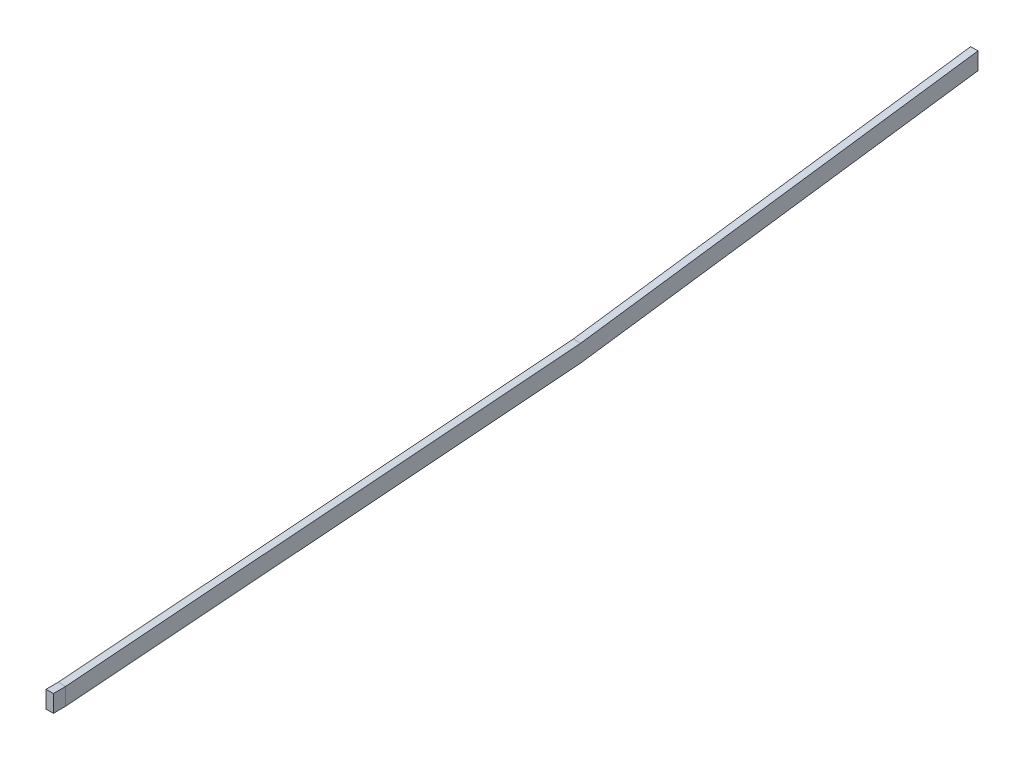
ISO-10303-21;
HEADER;
FILE_DESCRIPTION(('STEP AP214'),'2;1');
FILE_NAME('part.step','',(''),(''),'','','');
FILE_SCHEMA(('AUTOMOTIVE_DESIGN { 1 0 10303 214 1 1 1 1 }'));
ENDSEC;
DATA;
#1=APPLICATION_CONTEXT('core data for automotive mechanical design processes');
#2=APPLICATION_PROTOCOL_DEFINITION('international standard','automotive_design',2000,#1);
#3=PRODUCT_CONTEXT('',#1,'mechanical');
#4=PRODUCT('Part','Part','',(#3));
#5=PRODUCT_RELATED_PRODUCT_CATEGORY('part','',(#4));
#6=PRODUCT_DEFINITION_FORMATION('','',#4);
#7=PRODUCT_DEFINITION_CONTEXT('part definition',#1,'design');
#8=PRODUCT_DEFINITION('design','',#6,#7);
#9=PRODUCT_DEFINITION_SHAPE('','',#8);
#10=(LENGTH_UNIT() NAMED_UNIT(*) SI_UNIT(.MILLI.,.METRE.));
#11=(NAMED_UNIT(*) PLANE_ANGLE_UNIT() SI_UNIT($,.RADIAN.));
#12=(NAMED_UNIT(*) SI_UNIT($,.STERADIAN.) SOLID_ANGLE_UNIT());
#13=UNCERTAINTY_MEASURE_WITH_UNIT(LENGTH_MEASURE(1.E-05),#10,'distance_accuracy_value','');
#14=(GEOMETRIC_REPRESENTATION_CONTEXT(3) GLOBAL_UNCERTAINTY_ASSIGNED_CONTEXT((#13)) GLOBAL_UNIT_ASSIGNED_CONTEXT((#10,
#11,#12)) REPRESENTATION_CONTEXT('',''));
#15=CARTESIAN_POINT('',(0.,0.,0.));
#16=DIRECTION('',(0.,0.,1.));
#17=DIRECTION('',(1.,0.,0.));
#18=AXIS2_PLACEMENT_3D('',#15,#16,#17);
#19=CARTESIAN_POINT('',(0.,0.,0.));
#20=DIRECTION('',(0.,0.,-1.));
#21=DIRECTION('',(-1.,0.,0.));
#22=AXIS2_PLACEMENT_3D('',#19,#20,#21);
#23=PLANE('',#22);
#24=DIRECTION('',(0.,1.,0.));
#25=VECTOR('',#24,1.);
#26=CARTESIAN_POINT('',(3.,0.,0.));
#27=LINE('',#26,#25);
#28=CARTESIAN_POINT('',(3.,0.,0.));
#29=VERTEX_POINT('',#28);
#30=CARTESIAN_POINT('',(3.,7.,0.));
#31=VERTEX_POINT('',#30);
#32=EDGE_CURVE('E111',#29,#31,#27,.T.);
#33=ORIENTED_EDGE('',*,*,#32,.F.);
#34=DIRECTION('',(1.,0.,0.));
#35=VECTOR('',#34,1.);
#36=CARTESIAN_POINT('',(0.,0.,0.));
#37=LINE('',#36,#35);
#38=CARTESIAN_POINT('',(0.,0.,0.));
#39=VERTEX_POINT('',#38);
#40=EDGE_CURVE('E12',#39,#29,#37,.T.);
#41=ORIENTED_EDGE('',*,*,#40,.F.);
#42=DIRECTION('',(0.,1.,0.));
#43=VECTOR('',#42,1.);
#44=CARTESIAN_POINT('',(0.,0.,0.));
#45=LINE('',#44,#43);
#46=CARTESIAN_POINT('',(0.,7.,0.));
#47=VERTEX_POINT('',#46);
#48=EDGE_CURVE('E105',#39,#47,#45,.T.);
#49=ORIENTED_EDGE('',*,*,#48,.T.);
#50=DIRECTION('',(1.,0.,0.));
#51=VECTOR('',#50,1.);
#52=CARTESIAN_POINT('',(0.,7.,0.));
#53=LINE('',#52,#51);
#54=EDGE_CURVE('E50',#47,#31,#53,.T.);
#55=ORIENTED_EDGE('',*,*,#54,.T.);
#56=EDGE_LOOP('',(#33,#41,#49,#55));
#57=FACE_BOUND('',#56,.T.);
#58=ADVANCED_FACE('F47',(#57),#23,.T.);
#59=CARTESIAN_POINT('',(0.,0.,0.));
#60=DIRECTION('',(0.,-1.,0.));
#61=DIRECTION('',(0.,0.,-1.));
#62=AXIS2_PLACEMENT_3D('',#59,#60,#61);
#63=PLANE('',#62);
#64=DIRECTION('',(0.,0.,-1.));
#65=VECTOR('',#64,1.);
#66=CARTESIAN_POINT('',(3.,0.,0.));
#67=LINE('',#66,#65);
#68=CARTESIAN_POINT('',(3.,0.,5.));
#69=VERTEX_POINT('',#68);
#70=EDGE_CURVE('E107',#69,#29,#67,.T.);
#71=ORIENTED_EDGE('',*,*,#70,.F.);
#72=DIRECTION('',(1.,0.,0.));
#73=VECTOR('',#72,1.);
#74=CARTESIAN_POINT('',(0.,0.,5.));
#75=LINE('',#74,#73);
#76=CARTESIAN_POINT('',(0.,0.,5.));
#77=VERTEX_POINT('',#76);
#78=EDGE_CURVE('E56',#77,#69,#75,.T.);
#79=ORIENTED_EDGE('',*,*,#78,.F.);
#80=DIRECTION('',(0.,0.,-1.));
#81=VECTOR('',#80,1.);
#82=CARTESIAN_POINT('',(0.,0.,0.));
#83=LINE('',#82,#81);
#84=EDGE_CURVE('E102',#77,#39,#83,.T.);
#85=ORIENTED_EDGE('',*,*,#84,.T.);
#86=ORIENTED_EDGE('',*,*,#40,.T.);
#87=EDGE_LOOP('',(#71,#79,#85,#86));
#88=FACE_BOUND('',#87,.T.);
#89=ADVANCED_FACE('F121',(#88),#63,.T.);
#90=CARTESIAN_POINT('',(0.,0.,5.));
#91=DIRECTION('',(0.,0.,1.));
#92=DIRECTION('',(1.,0.,0.));
#93=AXIS2_PLACEMENT_3D('',#90,#91,#92);
#94=PLANE('',#93);
#95=DIRECTION('',(0.,-1.,0.));
#96=VECTOR('',#95,1.);
#97=CARTESIAN_POINT('',(3.,0.,5.));
#98=LINE('',#97,#96);
#99=CARTESIAN_POINT('',(3.,7.,5.));
#100=VERTEX_POINT('',#99);
#101=EDGE_CURVE('E97',#100,#69,#98,.T.);
#102=ORIENTED_EDGE('',*,*,#101,.F.);
#103=DIRECTION('',(1.,0.,0.));
#104=VECTOR('',#103,1.);
#105=CARTESIAN_POINT('',(0.,7.,5.));
#106=LINE('',#105,#104);
#107=CARTESIAN_POINT('',(0.,7.,5.));
#108=VERTEX_POINT('',#107);
#109=EDGE_CURVE('E92',#108,#100,#106,.T.);
#110=ORIENTED_EDGE('',*,*,#109,.F.);
#111=DIRECTION('',(0.,-1.,0.));
#112=VECTOR('',#111,1.);
#113=CARTESIAN_POINT('',(0.,0.,5.));
#114=LINE('',#113,#112);
#115=EDGE_CURVE('E95',#108,#77,#114,.T.);
#116=ORIENTED_EDGE('',*,*,#115,.T.);
#117=ORIENTED_EDGE('',*,*,#78,.T.);
#118=EDGE_LOOP('',(#102,#110,#116,#117));
#119=FACE_BOUND('',#118,.T.);
#120=ADVANCED_FACE('F94',(#119),#94,.T.);
#121=CARTESIAN_POINT('',(0.,7.,0.));
#122=DIRECTION('',(0.,1.,0.));
#123=DIRECTION('',(0.,0.,1.));
#124=AXIS2_PLACEMENT_3D('',#121,#122,#123);
#125=PLANE('',#124);
#126=DIRECTION('',(0.,0.,1.));
#127=VECTOR('',#126,1.);
#128=CARTESIAN_POINT('',(3.,7.,0.));
#129=LINE('',#128,#127);
#130=EDGE_CURVE('E114',#31,#100,#129,.T.);
#131=ORIENTED_EDGE('',*,*,#130,.F.);
#132=ORIENTED_EDGE('',*,*,#54,.F.);
#133=DIRECTION('',(0.,0.,1.));
#134=VECTOR('',#133,1.);
#135=CARTESIAN_POINT('',(0.,7.,0.));
#136=LINE('',#135,#134);
#137=EDGE_CURVE('E101',#47,#108,#136,.T.);
#138=ORIENTED_EDGE('',*,*,#137,.T.);
#139=ORIENTED_EDGE('',*,*,#109,.T.);
#140=EDGE_LOOP('',(#131,#132,#138,#139));
#141=FACE_BOUND('',#140,.T.);
#142=ADVANCED_FACE('F104',(#141),#125,.T.);
#143=CARTESIAN_POINT('',(0.,0.,0.));
#144=DIRECTION('',(1.,0.,0.));
#145=DIRECTION('',(0.,0.,-1.));
#146=AXIS2_PLACEMENT_3D('',#143,#144,#145);
#147=PLANE('',#146);
#148=ORIENTED_EDGE('',*,*,#48,.F.);
#149=ORIENTED_EDGE('',*,*,#84,.F.);
#150=ORIENTED_EDGE('',*,*,#115,.F.);
#151=ORIENTED_EDGE('',*,*,#137,.F.);
#152=EDGE_LOOP('',(#148,#149,#150,#151));
#153=FACE_BOUND('',#152,.T.);
#154=ADVANCED_FACE('F100',(#153),#147,.F.);
#155=CARTESIAN_POINT('',(3.,0.,0.));
#156=DIRECTION('',(1.,0.,0.));
#157=DIRECTION('',(0.,0.,-1.));
#158=AXIS2_PLACEMENT_3D('',#155,#156,#157);
#159=PLANE('',#158);
#160=ORIENTED_EDGE('',*,*,#32,.T.);
#161=ORIENTED_EDGE('',*,*,#130,.T.);
#162=ORIENTED_EDGE('',*,*,#101,.T.);
#163=ORIENTED_EDGE('',*,*,#70,.T.);
#164=EDGE_LOOP('',(#160,#161,#162,#163));
#165=FACE_BOUND('',#164,.T.);
#166=ADVANCED_FACE('F120',(#165),#159,.T.);
#167=CLOSED_SHELL('',(#58,#89,#120,#142,#154,#166));
#168=MANIFOLD_SOLID_BREP('B2',#167);
#169=CARTESIAN_POINT('',(3.,0.,0.));
#170=DIRECTION('',(0.,0.997039347044609,0.0768930454908585));
#171=DIRECTION('',(0.,-0.0768930454908585,0.997039347044609));
#172=AXIS2_PLACEMENT_3D('',#169,#170,#171);
#173=PLANE('',#172);
#174=DIRECTION('',(0.,0.0768930454908585,-0.997039347044609));
#175=VECTOR('',#174,1.);
#176=CARTESIAN_POINT('',(0.,0.,0.));
#177=LINE('',#176,#175);
#178=CARTESIAN_POINT('',(0.,0.,0.));
#179=VERTEX_POINT('',#178);
#180=CARTESIAN_POINT('',(0.,16.1954887747853,-210.));
#181=VERTEX_POINT('',#180);
#182=EDGE_CURVE('E267',#179,#181,#177,.T.);
#183=ORIENTED_EDGE('',*,*,#182,.T.);
#184=DIRECTION('',(-1.,0.,0.));
#185=VECTOR('',#184,1.);
#186=CARTESIAN_POINT('',(3.,16.1954887747853,-210.));
#187=LINE('',#186,#185);
#188=CARTESIAN_POINT('',(3.,16.1954887747853,-210.));
#189=VERTEX_POINT('',#188);
#190=EDGE_CURVE('E45',#189,#181,#187,.T.);
#191=ORIENTED_EDGE('',*,*,#190,.F.);
#192=DIRECTION('',(0.,0.0768930454908585,-0.997039347044609));
#193=VECTOR('',#192,1.);
#194=CARTESIAN_POINT('',(3.,0.,0.));
#195=LINE('',#194,#193);
#196=CARTESIAN_POINT('',(3.,0.,0.));
#197=VERTEX_POINT('',#196);
#198=EDGE_CURVE('E277',#197,#189,#195,.T.);
#199=ORIENTED_EDGE('',*,*,#198,.F.);
#200=DIRECTION('',(-1.,0.,0.));
#201=VECTOR('',#200,1.);
#202=CARTESIAN_POINT('',(3.,0.,0.));
#203=LINE('',#202,#201);
#204=EDGE_CURVE('E263',#197,#179,#203,.T.);
#205=ORIENTED_EDGE('',*,*,#204,.T.);
#206=EDGE_LOOP('',(#183,#191,#199,#205));
#207=FACE_BOUND('',#206,.T.);
#208=ADVANCED_FACE('F183',(#207),#173,.F.);
#209=CARTESIAN_POINT('',(3.,16.1954887747853,-210.));
#210=DIRECTION('',(0.,0.99072413854576,0.135888488485089));
#211=DIRECTION('',(0.,-0.135888488485089,0.99072413854576));
#212=AXIS2_PLACEMENT_3D('',#209,#210,#211);
#213=PLANE('',#212);
#214=DIRECTION('',(0.,0.135888488485089,-0.99072413854576));
#215=VECTOR('',#214,1.);
#216=CARTESIAN_POINT('',(0.,16.1954887747853,-210.));
#217=LINE('',#216,#215);
#218=CARTESIAN_POINT('',(0.,38.4155339701086,-372.));
#219=VERTEX_POINT('',#218);
#220=EDGE_CURVE('E270',#181,#219,#217,.T.);
#221=ORIENTED_EDGE('',*,*,#220,.T.);
#222=DIRECTION('',(-1.,0.,0.));
#223=VECTOR('',#222,1.);
#224=CARTESIAN_POINT('',(3.,38.4155339701086,-372.));
#225=LINE('',#224,#223);
#226=CARTESIAN_POINT('',(3.,38.4155339701086,-372.));
#227=VERTEX_POINT('',#226);
#228=EDGE_CURVE('E191',#227,#219,#225,.T.);
#229=ORIENTED_EDGE('',*,*,#228,.F.);
#230=DIRECTION('',(0.,0.135888488485089,-0.99072413854576));
#231=VECTOR('',#230,1.);
#232=CARTESIAN_POINT('',(3.,16.1954887747853,-210.));
#233=LINE('',#232,#231);
#234=EDGE_CURVE('E236',#189,#227,#233,.T.);
#235=ORIENTED_EDGE('',*,*,#234,.F.);
#236=ORIENTED_EDGE('',*,*,#190,.T.);
#237=EDGE_LOOP('',(#221,#229,#235,#236));
#238=FACE_BOUND('',#237,.T.);
#239=ADVANCED_FACE('F301',(#238),#213,.F.);
#240=CARTESIAN_POINT('',(3.,45.4155339701086,-372.));
#241=DIRECTION('',(0.,0.,1.));
#242=DIRECTION('',(1.,0.,0.));
#243=AXIS2_PLACEMENT_3D('',#240,#241,#242);
#244=PLANE('',#243);
#245=DIRECTION('',(0.,1.,0.));
#246=VECTOR('',#245,1.);
#247=CARTESIAN_POINT('',(0.,45.4155339701086,-372.));
#248=LINE('',#247,#246);
#249=CARTESIAN_POINT('',(0.,45.4155339701086,-372.));
#250=VERTEX_POINT('',#249);
#251=EDGE_CURVE('E272',#219,#250,#248,.T.);
#252=ORIENTED_EDGE('',*,*,#251,.T.);
#253=DIRECTION('',(-1.,0.,0.));
#254=VECTOR('',#253,1.);
#255=CARTESIAN_POINT('',(3.,45.4155339701086,-372.));
#256=LINE('',#255,#254);
#257=CARTESIAN_POINT('',(3.,45.4155339701086,-372.));
#258=VERTEX_POINT('',#257);
#259=EDGE_CURVE('E258',#258,#250,#256,.T.);
#260=ORIENTED_EDGE('',*,*,#259,.F.);
#261=DIRECTION('',(0.,1.,0.));
#262=VECTOR('',#261,1.);
#263=CARTESIAN_POINT('',(3.,45.4155339701086,-372.));
#264=LINE('',#263,#262);
#265=EDGE_CURVE('E249',#227,#258,#264,.T.);
#266=ORIENTED_EDGE('',*,*,#265,.F.);
#267=ORIENTED_EDGE('',*,*,#228,.T.);
#268=EDGE_LOOP('',(#252,#260,#266,#267));
#269=FACE_BOUND('',#268,.T.);
#270=ADVANCED_FACE('F283',(#269),#244,.F.);
#271=CARTESIAN_POINT('',(3.,23.1954887747853,-210.));
#272=DIRECTION('',(0.,-0.99072413854576,-0.135888488485089));
#273=DIRECTION('',(0.,0.135888488485089,-0.99072413854576));
#274=AXIS2_PLACEMENT_3D('',#271,#272,#273);
#275=PLANE('',#274);
#276=DIRECTION('',(0.,-0.135888488485089,0.99072413854576));
#277=VECTOR('',#276,1.);
#278=CARTESIAN_POINT('',(0.,23.1954887747853,-210.));
#279=LINE('',#278,#277);
#280=CARTESIAN_POINT('',(0.,23.1954887747853,-210.));
#281=VERTEX_POINT('',#280);
#282=EDGE_CURVE('E257',#250,#281,#279,.T.);
#283=ORIENTED_EDGE('',*,*,#282,.T.);
#284=DIRECTION('',(-1.,0.,0.));
#285=VECTOR('',#284,1.);
#286=CARTESIAN_POINT('',(3.,23.1954887747853,-210.));
#287=LINE('',#286,#285);
#288=CARTESIAN_POINT('',(3.,23.1954887747853,-210.));
#289=VERTEX_POINT('',#288);
#290=EDGE_CURVE('E254',#289,#281,#287,.T.);
#291=ORIENTED_EDGE('',*,*,#290,.F.);
#292=DIRECTION('',(0.,-0.135888488485089,0.99072413854576));
#293=VECTOR('',#292,1.);
#294=CARTESIAN_POINT('',(3.,23.1954887747853,-210.));
#295=LINE('',#294,#293);
#296=EDGE_CURVE('E243',#258,#289,#295,.T.);
#297=ORIENTED_EDGE('',*,*,#296,.F.);
#298=ORIENTED_EDGE('',*,*,#259,.T.);
#299=EDGE_LOOP('',(#283,#291,#297,#298));
#300=FACE_BOUND('',#299,.T.);
#301=ADVANCED_FACE('F255',(#300),#275,.F.);
#302=CARTESIAN_POINT('',(3.,7.,0.));
#303=DIRECTION('',(0.,-0.997039347044609,-0.0768930454908585));
#304=DIRECTION('',(0.,0.0768930454908585,-0.997039347044609));
#305=AXIS2_PLACEMENT_3D('',#302,#303,#304);
#306=PLANE('',#305);
#307=DIRECTION('',(0.,-0.0768930454908585,0.997039347044609));
#308=VECTOR('',#307,1.);
#309=CARTESIAN_POINT('',(0.,7.,0.));
#310=LINE('',#309,#308);
#311=CARTESIAN_POINT('',(0.,7.,0.));
#312=VERTEX_POINT('',#311);
#313=EDGE_CURVE('E222',#281,#312,#310,.T.);
#314=ORIENTED_EDGE('',*,*,#313,.T.);
#315=DIRECTION('',(-1.,0.,0.));
#316=VECTOR('',#315,1.);
#317=CARTESIAN_POINT('',(3.,7.,0.));
#318=LINE('',#317,#316);
#319=CARTESIAN_POINT('',(3.,7.,0.));
#320=VERTEX_POINT('',#319);
#321=EDGE_CURVE('E259',#320,#312,#318,.T.);
#322=ORIENTED_EDGE('',*,*,#321,.F.);
#323=DIRECTION('',(0.,-0.0768930454908585,0.997039347044609));
#324=VECTOR('',#323,1.);
#325=CARTESIAN_POINT('',(3.,7.,0.));
#326=LINE('',#325,#324);
#327=EDGE_CURVE('E247',#289,#320,#326,.T.);
#328=ORIENTED_EDGE('',*,*,#327,.F.);
#329=ORIENTED_EDGE('',*,*,#290,.T.);
#330=EDGE_LOOP('',(#314,#322,#328,#329));
#331=FACE_BOUND('',#330,.T.);
#332=ADVANCED_FACE('F261',(#331),#306,.F.);
#333=CARTESIAN_POINT('',(3.,0.,0.));
#334=DIRECTION('',(0.,0.,-1.));
#335=DIRECTION('',(-1.,0.,0.));
#336=AXIS2_PLACEMENT_3D('',#333,#334,#335);
#337=PLANE('',#336);
#338=DIRECTION('',(0.,-1.,0.));
#339=VECTOR('',#338,1.);
#340=CARTESIAN_POINT('',(0.,0.,0.));
#341=LINE('',#340,#339);
#342=EDGE_CURVE('E228',#312,#179,#341,.T.);
#343=ORIENTED_EDGE('',*,*,#342,.T.);
#344=ORIENTED_EDGE('',*,*,#204,.F.);
#345=DIRECTION('',(0.,-1.,0.));
#346=VECTOR('',#345,1.);
#347=CARTESIAN_POINT('',(3.,0.,0.));
#348=LINE('',#347,#346);
#349=EDGE_CURVE('E199',#320,#197,#348,.T.);
#350=ORIENTED_EDGE('',*,*,#349,.F.);
#351=ORIENTED_EDGE('',*,*,#321,.T.);
#352=EDGE_LOOP('',(#343,#344,#350,#351));
#353=FACE_BOUND('',#352,.T.);
#354=ADVANCED_FACE('F290',(#353),#337,.F.);
#355=CARTESIAN_POINT('',(3.,0.,0.));
#356=DIRECTION('',(-1.,0.,0.));
#357=DIRECTION('',(0.,0.,1.));
#358=AXIS2_PLACEMENT_3D('',#355,#356,#357);
#359=PLANE('',#358);
#360=ORIENTED_EDGE('',*,*,#198,.T.);
#361=ORIENTED_EDGE('',*,*,#234,.T.);
#362=ORIENTED_EDGE('',*,*,#265,.T.);
#363=ORIENTED_EDGE('',*,*,#296,.T.);
#364=ORIENTED_EDGE('',*,*,#327,.T.);
#365=ORIENTED_EDGE('',*,*,#349,.T.);
#366=EDGE_LOOP('',(#360,#361,#362,#363,#364,#365));
#367=FACE_BOUND('',#366,.T.);
#368=ADVANCED_FACE('F245',(#367),#359,.F.);
#369=CARTESIAN_POINT('',(0.,0.,0.));
#370=DIRECTION('',(-1.,0.,0.));
#371=DIRECTION('',(0.,0.,1.));
#372=AXIS2_PLACEMENT_3D('',#369,#370,#371);
#373=PLANE('',#372);
#374=ORIENTED_EDGE('',*,*,#182,.F.);
#375=ORIENTED_EDGE('',*,*,#342,.F.);
#376=ORIENTED_EDGE('',*,*,#313,.F.);
#377=ORIENTED_EDGE('',*,*,#282,.F.);
#378=ORIENTED_EDGE('',*,*,#251,.F.);
#379=ORIENTED_EDGE('',*,*,#220,.F.);
#380=EDGE_LOOP('',(#374,#375,#376,#377,#378,#379));
#381=FACE_BOUND('',#380,.T.);
#382=ADVANCED_FACE('F286',(#381),#373,.T.);
#383=CLOSED_SHELL('',(#208,#239,#270,#301,#332,#354,#368,#382));
#384=MANIFOLD_SOLID_BREP('B6',#383);
#385=ADVANCED_BREP_SHAPE_REPRESENTATION('',(#18,#168,#384),#14);
#386=SHAPE_DEFINITION_REPRESENTATION(#9,#385);
ENDSEC;
END-ISO-10303-21;
